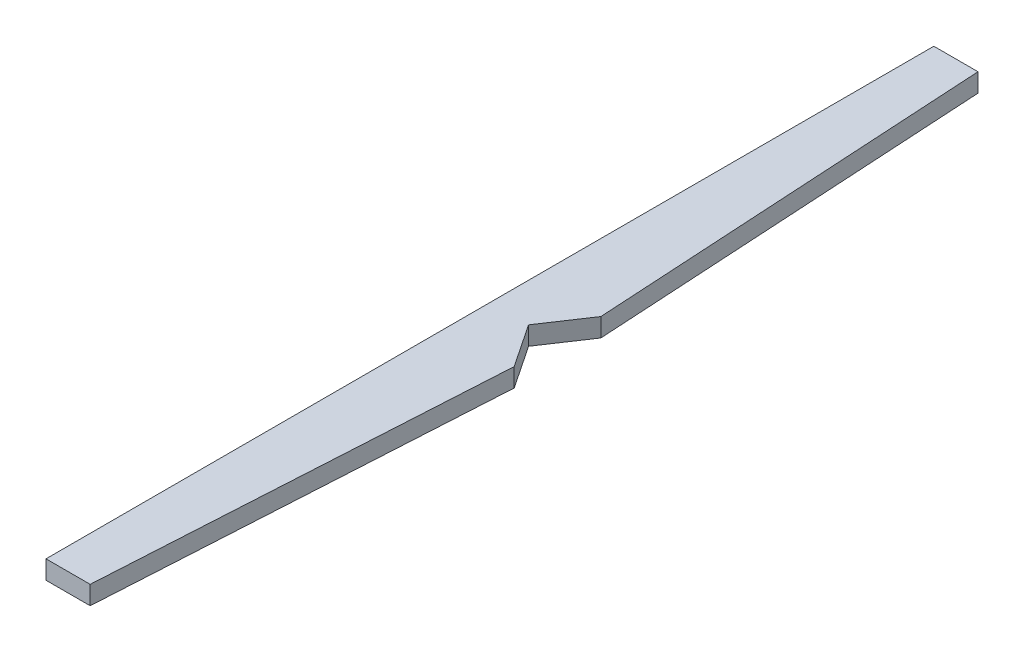
ISO-10303-21;
HEADER;
FILE_DESCRIPTION(('STEP AP214'),'2;1');
FILE_NAME('part.step','',(''),(''),'','','');
FILE_SCHEMA(('AUTOMOTIVE_DESIGN { 1 0 10303 214 1 1 1 1 }'));
ENDSEC;
DATA;
#1=APPLICATION_CONTEXT('core data for automotive mechanical design processes');
#2=APPLICATION_PROTOCOL_DEFINITION('international standard','automotive_design',2000,#1);
#3=PRODUCT_CONTEXT('',#1,'mechanical');
#4=PRODUCT('Part','Part','',(#3));
#5=PRODUCT_RELATED_PRODUCT_CATEGORY('part','',(#4));
#6=PRODUCT_DEFINITION_FORMATION('','',#4);
#7=PRODUCT_DEFINITION_CONTEXT('part definition',#1,'design');
#8=PRODUCT_DEFINITION('design','',#6,#7);
#9=PRODUCT_DEFINITION_SHAPE('','',#8);
#10=(LENGTH_UNIT() NAMED_UNIT(*) SI_UNIT(.MILLI.,.METRE.));
#11=(NAMED_UNIT(*) PLANE_ANGLE_UNIT() SI_UNIT($,.RADIAN.));
#12=(NAMED_UNIT(*) SI_UNIT($,.STERADIAN.) SOLID_ANGLE_UNIT());
#13=UNCERTAINTY_MEASURE_WITH_UNIT(LENGTH_MEASURE(1.E-05),#10,'distance_accuracy_value','');
#14=(GEOMETRIC_REPRESENTATION_CONTEXT(3) GLOBAL_UNCERTAINTY_ASSIGNED_CONTEXT((#13)) GLOBAL_UNIT_ASSIGNED_CONTEXT((#10,
#11,#12)) REPRESENTATION_CONTEXT('',''));
#15=CARTESIAN_POINT('',(0.,0.,0.));
#16=DIRECTION('',(0.,0.,1.));
#17=DIRECTION('',(1.,0.,0.));
#18=AXIS2_PLACEMENT_3D('',#15,#16,#17);
#19=CARTESIAN_POINT('',(0.,15.,358.35));
#20=DIRECTION('',(0.,0.,-1.));
#21=DIRECTION('',(-1.,0.,0.));
#22=AXIS2_PLACEMENT_3D('',#19,#20,#21);
#23=PLANE('',#22);
#24=DIRECTION('',(1.,0.,0.));
#25=VECTOR('',#24,1.);
#26=CARTESIAN_POINT('',(0.,0.,358.35));
#27=LINE('',#26,#25);
#28=CARTESIAN_POINT('',(0.,0.,358.35));
#29=VERTEX_POINT('',#28);
#30=CARTESIAN_POINT('',(35.6506003430532,0.,358.35));
#31=VERTEX_POINT('',#30);
#32=EDGE_CURVE('E123',#29,#31,#27,.T.);
#33=ORIENTED_EDGE('',*,*,#32,.T.);
#34=DIRECTION('',(0.,-1.,0.));
#35=VECTOR('',#34,1.);
#36=CARTESIAN_POINT('',(35.6506003430532,15.,358.35));
#37=LINE('',#36,#35);
#38=CARTESIAN_POINT('',(35.6506003430532,15.,358.35));
#39=VERTEX_POINT('',#38);
#40=EDGE_CURVE('E11',#39,#31,#37,.T.);
#41=ORIENTED_EDGE('',*,*,#40,.F.);
#42=DIRECTION('',(1.,0.,0.));
#43=VECTOR('',#42,1.);
#44=CARTESIAN_POINT('',(0.,15.,358.35));
#45=LINE('',#44,#43);
#46=CARTESIAN_POINT('',(0.,15.,358.35));
#47=VERTEX_POINT('',#46);
#48=EDGE_CURVE('E135',#47,#39,#45,.T.);
#49=ORIENTED_EDGE('',*,*,#48,.F.);
#50=DIRECTION('',(0.,-1.,0.));
#51=VECTOR('',#50,1.);
#52=CARTESIAN_POINT('',(0.,15.,358.35));
#53=LINE('',#52,#51);
#54=EDGE_CURVE('E119',#47,#29,#53,.T.);
#55=ORIENTED_EDGE('',*,*,#54,.T.);
#56=EDGE_LOOP('',(#33,#41,#49,#55));
#57=FACE_BOUND('',#56,.T.);
#58=ADVANCED_FACE('F33',(#57),#23,.F.);
#59=CARTESIAN_POINT('',(35.6506003430532,15.,358.35));
#60=DIRECTION('',(-0.998292209621749,0.,-0.0584180127060605));
#61=DIRECTION('',(-0.0584180127060605,0.,0.998292209621749));
#62=AXIS2_PLACEMENT_3D('',#59,#60,#61);
#63=PLANE('',#62);
#64=DIRECTION('',(0.0584180127060605,0.,-0.998292209621749));
#65=VECTOR('',#64,1.);
#66=CARTESIAN_POINT('',(35.6506003430532,0.,358.35));
#67=LINE('',#66,#65);
#68=CARTESIAN_POINT('',(54.5725000682154,0.,34.9979342267377));
#69=VERTEX_POINT('',#68);
#70=EDGE_CURVE('E126',#31,#69,#67,.T.);
#71=ORIENTED_EDGE('',*,*,#70,.T.);
#72=DIRECTION('',(0.,-1.,0.));
#73=VECTOR('',#72,1.);
#74=CARTESIAN_POINT('',(54.5725000682154,15.,34.9979342267377));
#75=LINE('',#74,#73);
#76=CARTESIAN_POINT('',(54.5725000682154,15.,34.9979342267377));
#77=VERTEX_POINT('',#76);
#78=EDGE_CURVE('E41',#77,#69,#75,.T.);
#79=ORIENTED_EDGE('',*,*,#78,.F.);
#80=DIRECTION('',(0.0584180127060605,0.,-0.998292209621749));
#81=VECTOR('',#80,1.);
#82=CARTESIAN_POINT('',(35.6506003430532,15.,358.35));
#83=LINE('',#82,#81);
#84=EDGE_CURVE('E89',#39,#77,#83,.T.);
#85=ORIENTED_EDGE('',*,*,#84,.F.);
#86=ORIENTED_EDGE('',*,*,#40,.T.);
#87=EDGE_LOOP('',(#71,#79,#85,#86));
#88=FACE_BOUND('',#87,.T.);
#89=ADVANCED_FACE('F160',(#88),#63,.F.);
#90=CARTESIAN_POINT('',(31.1965583700854,15.,0.));
#91=DIRECTION('',(-0.831567617782309,0.,0.555423529440242));
#92=DIRECTION('',(0.555423529440242,0.,0.831567617782309));
#93=AXIS2_PLACEMENT_3D('',#90,#91,#92);
#94=PLANE('',#93);
#95=DIRECTION('',(-0.555423529440242,0.,-0.831567617782309));
#96=VECTOR('',#95,1.);
#97=CARTESIAN_POINT('',(31.1965583700854,0.,0.));
#98=LINE('',#97,#96);
#99=CARTESIAN_POINT('',(31.1965583700854,0.,0.));
#100=VERTEX_POINT('',#99);
#101=EDGE_CURVE('E128',#69,#100,#98,.T.);
#102=ORIENTED_EDGE('',*,*,#101,.T.);
#103=DIRECTION('',(0.,-1.,0.));
#104=VECTOR('',#103,1.);
#105=CARTESIAN_POINT('',(31.1965583700854,15.,0.));
#106=LINE('',#105,#104);
#107=CARTESIAN_POINT('',(31.1965583700854,15.,0.));
#108=VERTEX_POINT('',#107);
#109=EDGE_CURVE('E139',#108,#100,#106,.T.);
#110=ORIENTED_EDGE('',*,*,#109,.F.);
#111=DIRECTION('',(-0.555423529440242,0.,-0.831567617782309));
#112=VECTOR('',#111,1.);
#113=CARTESIAN_POINT('',(31.1965583700854,15.,0.));
#114=LINE('',#113,#112);
#115=EDGE_CURVE('E147',#77,#108,#114,.T.);
#116=ORIENTED_EDGE('',*,*,#115,.F.);
#117=ORIENTED_EDGE('',*,*,#78,.T.);
#118=EDGE_LOOP('',(#102,#110,#116,#117));
#119=FACE_BOUND('',#118,.T.);
#120=ADVANCED_FACE('F145',(#119),#94,.F.);
#121=CARTESIAN_POINT('',(54.5725000682152,15.,-34.9979342267443));
#122=DIRECTION('',(-0.83156761778236,0.,-0.555423529440167));
#123=DIRECTION('',(-0.555423529440167,0.,0.83156761778236));
#124=AXIS2_PLACEMENT_3D('',#121,#122,#123);
#125=PLANE('',#124);
#126=DIRECTION('',(0.555423529440167,0.,-0.83156761778236));
#127=VECTOR('',#126,1.);
#128=CARTESIAN_POINT('',(54.5725000682152,0.,-34.9979342267443));
#129=LINE('',#128,#127);
#130=CARTESIAN_POINT('',(54.5725000682152,0.,-34.9979342267443));
#131=VERTEX_POINT('',#130);
#132=EDGE_CURVE('E130',#100,#131,#129,.T.);
#133=ORIENTED_EDGE('',*,*,#132,.T.);
#134=DIRECTION('',(0.,-1.,0.));
#135=VECTOR('',#134,1.);
#136=CARTESIAN_POINT('',(54.5725000682152,15.,-34.9979342267443));
#137=LINE('',#136,#135);
#138=CARTESIAN_POINT('',(54.5725000682152,15.,-34.9979342267443));
#139=VERTEX_POINT('',#138);
#140=EDGE_CURVE('E114',#139,#131,#137,.T.);
#141=ORIENTED_EDGE('',*,*,#140,.F.);
#142=DIRECTION('',(0.555423529440167,0.,-0.83156761778236));
#143=VECTOR('',#142,1.);
#144=CARTESIAN_POINT('',(54.5725000682152,15.,-34.9979342267443));
#145=LINE('',#144,#143);
#146=EDGE_CURVE('E105',#108,#139,#145,.T.);
#147=ORIENTED_EDGE('',*,*,#146,.F.);
#148=ORIENTED_EDGE('',*,*,#109,.T.);
#149=EDGE_LOOP('',(#133,#141,#147,#148));
#150=FACE_BOUND('',#149,.T.);
#151=ADVANCED_FACE('F153',(#150),#125,.F.);
#152=CARTESIAN_POINT('',(54.5725000682152,15.,-34.9979342267443));
#153=DIRECTION('',(-0.998292209621749,0.,0.0584180127060611));
#154=DIRECTION('',(0.0584180127060611,0.,0.998292209621749));
#155=AXIS2_PLACEMENT_3D('',#152,#153,#154);
#156=PLANE('',#155);
#157=DIRECTION('',(-0.0584180127060611,0.,-0.998292209621749));
#158=VECTOR('',#157,1.);
#159=CARTESIAN_POINT('',(54.5725000682152,0.,-34.9979342267443));
#160=LINE('',#159,#158);
#161=CARTESIAN_POINT('',(35.6506003430532,0.,-358.35));
#162=VERTEX_POINT('',#161);
#163=EDGE_CURVE('E113',#131,#162,#160,.T.);
#164=ORIENTED_EDGE('',*,*,#163,.T.);
#165=DIRECTION('',(0.,-1.,0.));
#166=VECTOR('',#165,1.);
#167=CARTESIAN_POINT('',(35.6506003430532,15.,-358.35));
#168=LINE('',#167,#166);
#169=CARTESIAN_POINT('',(35.6506003430532,15.,-358.35));
#170=VERTEX_POINT('',#169);
#171=EDGE_CURVE('E110',#170,#162,#168,.T.);
#172=ORIENTED_EDGE('',*,*,#171,.F.);
#173=DIRECTION('',(-0.0584180127060611,0.,-0.998292209621749));
#174=VECTOR('',#173,1.);
#175=CARTESIAN_POINT('',(54.5725000682152,15.,-34.9979342267443));
#176=LINE('',#175,#174);
#177=EDGE_CURVE('E99',#139,#170,#176,.T.);
#178=ORIENTED_EDGE('',*,*,#177,.F.);
#179=ORIENTED_EDGE('',*,*,#140,.T.);
#180=EDGE_LOOP('',(#164,#172,#178,#179));
#181=FACE_BOUND('',#180,.T.);
#182=ADVANCED_FACE('F111',(#181),#156,.F.);
#183=CARTESIAN_POINT('',(35.6506003430532,15.,-358.35));
#184=DIRECTION('',(0.,0.,1.));
#185=DIRECTION('',(1.,0.,0.));
#186=AXIS2_PLACEMENT_3D('',#183,#184,#185);
#187=PLANE('',#186);
#188=DIRECTION('',(-1.,0.,0.));
#189=VECTOR('',#188,1.);
#190=CARTESIAN_POINT('',(35.6506003430532,0.,-358.35));
#191=LINE('',#190,#189);
#192=CARTESIAN_POINT('',(0.,0.,-358.35));
#193=VERTEX_POINT('',#192);
#194=EDGE_CURVE('E75',#162,#193,#191,.T.);
#195=ORIENTED_EDGE('',*,*,#194,.T.);
#196=DIRECTION('',(0.,-1.,0.));
#197=VECTOR('',#196,1.);
#198=CARTESIAN_POINT('',(0.,15.,-358.35));
#199=LINE('',#198,#197);
#200=CARTESIAN_POINT('',(0.,15.,-358.35));
#201=VERTEX_POINT('',#200);
#202=EDGE_CURVE('E115',#201,#193,#199,.T.);
#203=ORIENTED_EDGE('',*,*,#202,.F.);
#204=DIRECTION('',(-1.,0.,0.));
#205=VECTOR('',#204,1.);
#206=CARTESIAN_POINT('',(35.6506003430532,15.,-358.35));
#207=LINE('',#206,#205);
#208=EDGE_CURVE('E103',#170,#201,#207,.T.);
#209=ORIENTED_EDGE('',*,*,#208,.F.);
#210=ORIENTED_EDGE('',*,*,#171,.T.);
#211=EDGE_LOOP('',(#195,#203,#209,#210));
#212=FACE_BOUND('',#211,.T.);
#213=ADVANCED_FACE('F117',(#212),#187,.F.);
#214=CARTESIAN_POINT('',(0.,15.,-358.35));
#215=DIRECTION('',(1.,0.,0.));
#216=DIRECTION('',(0.,0.,-1.));
#217=AXIS2_PLACEMENT_3D('',#214,#215,#216);
#218=PLANE('',#217);
#219=DIRECTION('',(0.,0.,1.));
#220=VECTOR('',#219,1.);
#221=CARTESIAN_POINT('',(0.,0.,-358.35));
#222=LINE('',#221,#220);
#223=EDGE_CURVE('E81',#193,#29,#222,.T.);
#224=ORIENTED_EDGE('',*,*,#223,.T.);
#225=ORIENTED_EDGE('',*,*,#54,.F.);
#226=DIRECTION('',(0.,0.,1.));
#227=VECTOR('',#226,1.);
#228=CARTESIAN_POINT('',(0.,15.,-358.35));
#229=LINE('',#228,#227);
#230=EDGE_CURVE('E49',#201,#47,#229,.T.);
#231=ORIENTED_EDGE('',*,*,#230,.F.);
#232=ORIENTED_EDGE('',*,*,#202,.T.);
#233=EDGE_LOOP('',(#224,#225,#231,#232));
#234=FACE_BOUND('',#233,.T.);
#235=ADVANCED_FACE('F174',(#234),#218,.F.);
#236=CARTESIAN_POINT('',(0.,15.,0.));
#237=DIRECTION('',(0.,-1.,0.));
#238=DIRECTION('',(0.,0.,-1.));
#239=AXIS2_PLACEMENT_3D('',#236,#237,#238);
#240=PLANE('',#239);
#241=ORIENTED_EDGE('',*,*,#48,.T.);
#242=ORIENTED_EDGE('',*,*,#84,.T.);
#243=ORIENTED_EDGE('',*,*,#115,.T.);
#244=ORIENTED_EDGE('',*,*,#146,.T.);
#245=ORIENTED_EDGE('',*,*,#177,.T.);
#246=ORIENTED_EDGE('',*,*,#208,.T.);
#247=ORIENTED_EDGE('',*,*,#230,.T.);
#248=EDGE_LOOP('',(#241,#242,#243,#244,#245,#246,#247));
#249=FACE_BOUND('',#248,.T.);
#250=ADVANCED_FACE('F101',(#249),#240,.F.);
#251=CARTESIAN_POINT('',(0.,0.,0.));
#252=DIRECTION('',(0.,-1.,0.));
#253=DIRECTION('',(0.,0.,-1.));
#254=AXIS2_PLACEMENT_3D('',#251,#252,#253);
#255=PLANE('',#254);
#256=ORIENTED_EDGE('',*,*,#32,.F.);
#257=ORIENTED_EDGE('',*,*,#223,.F.);
#258=ORIENTED_EDGE('',*,*,#194,.F.);
#259=ORIENTED_EDGE('',*,*,#163,.F.);
#260=ORIENTED_EDGE('',*,*,#132,.F.);
#261=ORIENTED_EDGE('',*,*,#101,.F.);
#262=ORIENTED_EDGE('',*,*,#70,.F.);
#263=EDGE_LOOP('',(#256,#257,#258,#259,#260,#261,#262));
#264=FACE_BOUND('',#263,.T.);
#265=ADVANCED_FACE('F151',(#264),#255,.T.);
#266=CLOSED_SHELL('',(#58,#89,#120,#151,#182,#213,#235,#250,#265));
#267=MANIFOLD_SOLID_BREP('B2',#266);
#268=ADVANCED_BREP_SHAPE_REPRESENTATION('',(#18,#267),#14);
#269=SHAPE_DEFINITION_REPRESENTATION(#9,#268);
ENDSEC;
END-ISO-10303-21;
